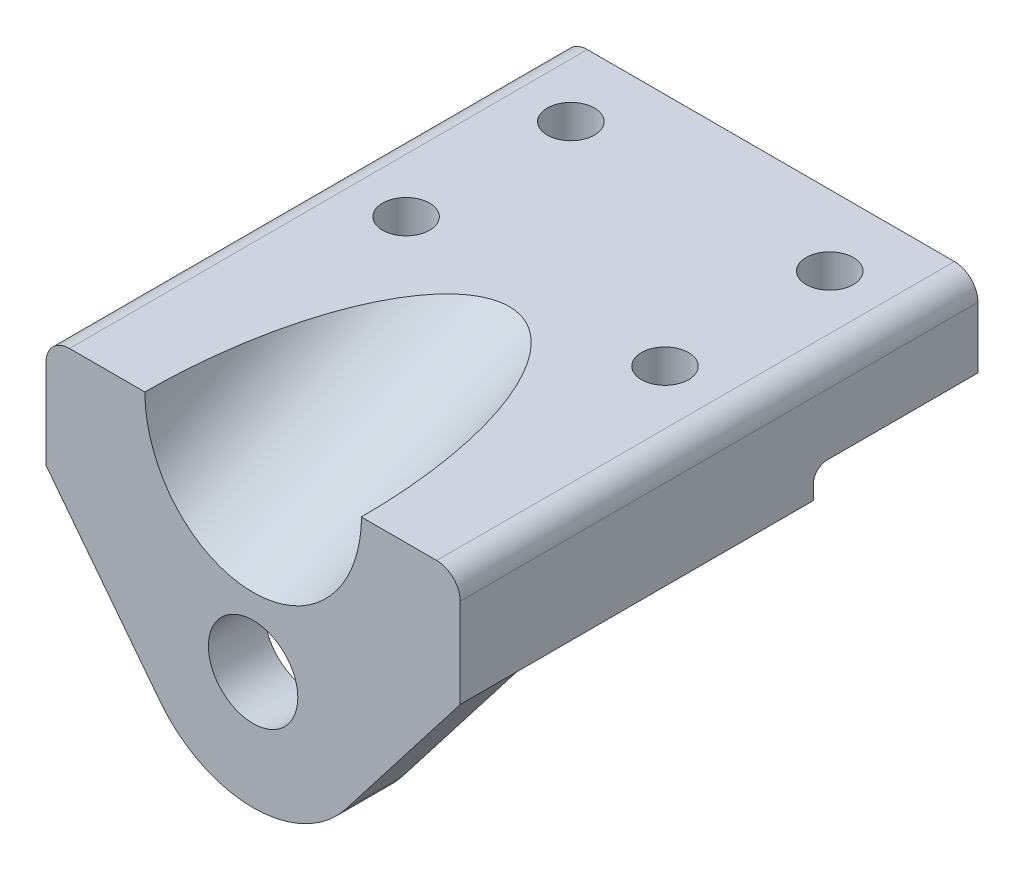
ISO-10303-21;
HEADER;
FILE_DESCRIPTION(('STEP AP214'),'2;1');
FILE_NAME('part.step','',(''),(''),'','','');
FILE_SCHEMA(('AUTOMOTIVE_DESIGN { 1 0 10303 214 1 1 1 1 }'));
ENDSEC;
DATA;
#1=APPLICATION_CONTEXT('core data for automotive mechanical design processes');
#2=APPLICATION_PROTOCOL_DEFINITION('international standard','automotive_design',2000,#1);
#3=PRODUCT_CONTEXT('',#1,'mechanical');
#4=PRODUCT('Part','Part','',(#3));
#5=PRODUCT_RELATED_PRODUCT_CATEGORY('part','',(#4));
#6=PRODUCT_DEFINITION_FORMATION('','',#4);
#7=PRODUCT_DEFINITION_CONTEXT('part definition',#1,'design');
#8=PRODUCT_DEFINITION('design','',#6,#7);
#9=PRODUCT_DEFINITION_SHAPE('','',#8);
#10=(LENGTH_UNIT() NAMED_UNIT(*) SI_UNIT(.MILLI.,.METRE.));
#11=(NAMED_UNIT(*) PLANE_ANGLE_UNIT() SI_UNIT($,.RADIAN.));
#12=(NAMED_UNIT(*) SI_UNIT($,.STERADIAN.) SOLID_ANGLE_UNIT());
#13=UNCERTAINTY_MEASURE_WITH_UNIT(LENGTH_MEASURE(1.E-05),#10,'distance_accuracy_value','');
#14=(GEOMETRIC_REPRESENTATION_CONTEXT(3) GLOBAL_UNCERTAINTY_ASSIGNED_CONTEXT((#13)) GLOBAL_UNIT_ASSIGNED_CONTEXT((#10,
#11,#12)) REPRESENTATION_CONTEXT('',''));
#15=CARTESIAN_POINT('',(0.,0.,0.));
#16=DIRECTION('',(0.,0.,1.));
#17=DIRECTION('',(1.,0.,0.));
#18=AXIS2_PLACEMENT_3D('',#15,#16,#17);
#19=CARTESIAN_POINT('',(44.,-24.,0.));
#20=DIRECTION('',(1.,0.,0.));
#21=DIRECTION('',(0.,0.,-1.));
#22=AXIS2_PLACEMENT_3D('',#19,#20,#21);
#23=PLANE('',#22);
#24=DIRECTION('',(0.,-1.,0.));
#25=VECTOR('',#24,1.);
#26=CARTESIAN_POINT('',(44.,-24.,-75.));
#27=LINE('',#26,#25);
#28=CARTESIAN_POINT('',(44.,-21.,-75.));
#29=VERTEX_POINT('',#28);
#30=CARTESIAN_POINT('',(44.,-24.,-75.));
#31=VERTEX_POINT('',#30);
#32=EDGE_CURVE('E243',#29,#31,#27,.T.);
#33=ORIENTED_EDGE('',*,*,#32,.F.);
#34=CARTESIAN_POINT('',(44.,-21.,-78.));
#35=DIRECTION('',(1.,0.,0.));
#36=DIRECTION('',(0.,0.,-1.));
#37=AXIS2_PLACEMENT_3D('',#34,#35,#36);
#38=CIRCLE('',#37,3.);
#39=CARTESIAN_POINT('',(44.,-18.,-78.));
#40=VERTEX_POINT('',#39);
#41=EDGE_CURVE('E220',#29,#40,#38,.F.);
#42=ORIENTED_EDGE('',*,*,#41,.T.);
#43=DIRECTION('',(0.,0.,-1.));
#44=VECTOR('',#43,1.);
#45=CARTESIAN_POINT('',(44.,-18.,-75.));
#46=LINE('',#45,#44);
#47=CARTESIAN_POINT('',(44.,-18.,-110.));
#48=VERTEX_POINT('',#47);
#49=EDGE_CURVE('E214',#40,#48,#46,.T.);
#50=ORIENTED_EDGE('',*,*,#49,.T.);
#51=DIRECTION('',(0.,1.,0.));
#52=VECTOR('',#51,1.);
#53=CARTESIAN_POINT('',(44.,-24.,-110.));
#54=LINE('',#53,#52);
#55=CARTESIAN_POINT('',(44.,-5.,-110.));
#56=VERTEX_POINT('',#55);
#57=EDGE_CURVE('E179',#48,#56,#54,.T.);
#58=ORIENTED_EDGE('',*,*,#57,.T.);
#59=DIRECTION('',(0.,0.,-1.));
#60=VECTOR('',#59,1.);
#61=CARTESIAN_POINT('',(44.,-5.,0.));
#62=LINE('',#61,#60);
#63=CARTESIAN_POINT('',(44.,-5.,0.));
#64=VERTEX_POINT('',#63);
#65=EDGE_CURVE('E205',#56,#64,#62,.F.);
#66=ORIENTED_EDGE('',*,*,#65,.T.);
#67=DIRECTION('',(0.,1.,0.));
#68=VECTOR('',#67,1.);
#69=CARTESIAN_POINT('',(44.,-24.,0.));
#70=LINE('',#69,#68);
#71=CARTESIAN_POINT('',(44.,-24.,0.));
#72=VERTEX_POINT('',#71);
#73=EDGE_CURVE('E167',#72,#64,#70,.T.);
#74=ORIENTED_EDGE('',*,*,#73,.F.);
#75=DIRECTION('',(0.,0.,-1.));
#76=VECTOR('',#75,1.);
#77=CARTESIAN_POINT('',(44.,-24.,0.));
#78=LINE('',#77,#76);
#79=CARTESIAN_POINT('',(44.,-24.,-12.));
#80=VERTEX_POINT('',#79);
#81=EDGE_CURVE('E161',#72,#80,#78,.T.);
#82=ORIENTED_EDGE('',*,*,#81,.T.);
#83=EDGE_CURVE('E156',#80,#31,#78,.T.);
#84=ORIENTED_EDGE('',*,*,#83,.T.);
#85=EDGE_LOOP('',(#33,#42,#50,#58,#66,#74,#82,#84));
#86=FACE_BOUND('',#85,.T.);
#87=ADVANCED_FACE('F43',(#86),#23,.T.);
#88=CARTESIAN_POINT('',(-44.,-24.,0.));
#89=DIRECTION('',(0.,0.,1.));
#90=DIRECTION('',(1.,0.,0.));
#91=AXIS2_PLACEMENT_3D('',#88,#89,#90);
#92=PLANE('',#91);
#93=DIRECTION('',(1.,0.,0.));
#94=VECTOR('',#93,1.);
#95=CARTESIAN_POINT('',(-44.,0.,0.));
#96=LINE('',#95,#94);
#97=CARTESIAN_POINT('',(23.,0.,0.));
#98=VERTEX_POINT('',#97);
#99=CARTESIAN_POINT('',(39.,0.,0.));
#100=VERTEX_POINT('',#99);
#101=EDGE_CURVE('E146',#98,#100,#96,.T.);
#102=ORIENTED_EDGE('',*,*,#101,.F.);
#103=CARTESIAN_POINT('',(0.,0.,0.));
#104=DIRECTION('',(0.,0.,1.));
#105=DIRECTION('',(0.,-1.,0.));
#106=AXIS2_PLACEMENT_3D('',#103,#104,#105);
#107=ELLIPSE('',#106,25.3776921361373,23.);
#108=CARTESIAN_POINT('',(-23.,0.,0.));
#109=VERTEX_POINT('',#108);
#110=EDGE_CURVE('E58',#98,#109,#107,.F.);
#111=ORIENTED_EDGE('',*,*,#110,.T.);
#112=CARTESIAN_POINT('',(-39.,0.,0.));
#113=VERTEX_POINT('',#112);
#114=EDGE_CURVE('E144',#113,#109,#96,.T.);
#115=ORIENTED_EDGE('',*,*,#114,.F.);
#116=CARTESIAN_POINT('',(-39.,-5.,0.));
#117=DIRECTION('',(0.,0.,1.));
#118=DIRECTION('',(1.,0.,0.));
#119=AXIS2_PLACEMENT_3D('',#116,#117,#118);
#120=CIRCLE('',#119,5.);
#121=CARTESIAN_POINT('',(-44.,-5.,0.));
#122=VERTEX_POINT('',#121);
#123=EDGE_CURVE('E191',#113,#122,#120,.T.);
#124=ORIENTED_EDGE('',*,*,#123,.T.);
#125=DIRECTION('',(0.,1.,0.));
#126=VECTOR('',#125,1.);
#127=CARTESIAN_POINT('',(-44.,-24.,0.));
#128=LINE('',#127,#126);
#129=CARTESIAN_POINT('',(-44.,-24.,0.));
#130=VERTEX_POINT('',#129);
#131=EDGE_CURVE('E172',#130,#122,#128,.T.);
#132=ORIENTED_EDGE('',*,*,#131,.F.);
#133=DIRECTION('',(0.612114706356877,-0.790768984129773,0.));
#134=VECTOR('',#133,1.);
#135=CARTESIAN_POINT('',(-44.,-24.,0.));
#136=LINE('',#135,#134);
#137=CARTESIAN_POINT('',(-19.7692246032443,-55.3028676589219,0.));
#138=VERTEX_POINT('',#137);
#139=EDGE_CURVE('E262',#130,#138,#136,.T.);
#140=ORIENTED_EDGE('',*,*,#139,.T.);
#141=CARTESIAN_POINT('',(0.,-40.,0.));
#142=DIRECTION('',(0.,0.,1.));
#143=DIRECTION('',(1.,0.,0.));
#144=AXIS2_PLACEMENT_3D('',#141,#142,#143);
#145=CIRCLE('',#144,25.);
#146=CARTESIAN_POINT('',(19.7692246032443,-55.3028676589219,0.));
#147=VERTEX_POINT('',#146);
#148=EDGE_CURVE('E287',#138,#147,#145,.T.);
#149=ORIENTED_EDGE('',*,*,#148,.T.);
#150=DIRECTION('',(0.612114706356877,0.790768984129774,0.));
#151=VECTOR('',#150,1.);
#152=CARTESIAN_POINT('',(44.,-24.,0.));
#153=LINE('',#152,#151);
#154=EDGE_CURVE('E271',#147,#72,#153,.T.);
#155=ORIENTED_EDGE('',*,*,#154,.T.);
#156=ORIENTED_EDGE('',*,*,#73,.T.);
#157=CARTESIAN_POINT('',(39.,-5.,0.));
#158=DIRECTION('',(0.,0.,1.));
#159=DIRECTION('',(1.,0.,0.));
#160=AXIS2_PLACEMENT_3D('',#157,#158,#159);
#161=CIRCLE('',#160,5.);
#162=EDGE_CURVE('E188',#64,#100,#161,.T.);
#163=ORIENTED_EDGE('',*,*,#162,.T.);
#164=EDGE_LOOP('',(#102,#111,#115,#124,#132,#140,#149,#155,#156,#163));
#165=FACE_BOUND('',#164,.T.);
#166=CARTESIAN_POINT('',(0.,-40.,0.));
#167=DIRECTION('',(0.,0.,1.));
#168=DIRECTION('',(1.,0.,0.));
#169=AXIS2_PLACEMENT_3D('',#166,#167,#168);
#170=CIRCLE('',#169,9.5);
#171=CARTESIAN_POINT('',(9.5,-40.,0.));
#172=VERTEX_POINT('',#171);
#173=EDGE_CURVE('E257',#172,#172,#170,.T.);
#174=ORIENTED_EDGE('',*,*,#173,.F.);
#175=EDGE_LOOP('',(#174));
#176=FACE_BOUND('',#175,.T.);
#177=ADVANCED_FACE('F142',(#165,#176),#92,.T.);
#178=CARTESIAN_POINT('',(-44.,-24.,-110.));
#179=DIRECTION('',(-1.,0.,0.));
#180=DIRECTION('',(0.,0.,1.));
#181=AXIS2_PLACEMENT_3D('',#178,#179,#180);
#182=PLANE('',#181);
#183=DIRECTION('',(0.,0.,-1.));
#184=VECTOR('',#183,1.);
#185=CARTESIAN_POINT('',(-44.,-18.,-75.));
#186=LINE('',#185,#184);
#187=CARTESIAN_POINT('',(-44.,-18.,-78.));
#188=VERTEX_POINT('',#187);
#189=CARTESIAN_POINT('',(-44.,-18.,-110.));
#190=VERTEX_POINT('',#189);
#191=EDGE_CURVE('E231',#188,#190,#186,.T.);
#192=ORIENTED_EDGE('',*,*,#191,.F.);
#193=CARTESIAN_POINT('',(-44.,-21.,-78.));
#194=DIRECTION('',(-1.,0.,0.));
#195=DIRECTION('',(0.,0.,1.));
#196=AXIS2_PLACEMENT_3D('',#193,#194,#195);
#197=CIRCLE('',#196,3.);
#198=CARTESIAN_POINT('',(-44.,-21.,-75.));
#199=VERTEX_POINT('',#198);
#200=EDGE_CURVE('E52',#188,#199,#197,.F.);
#201=ORIENTED_EDGE('',*,*,#200,.T.);
#202=DIRECTION('',(0.,1.,0.));
#203=VECTOR('',#202,1.);
#204=CARTESIAN_POINT('',(-44.,-24.,-75.));
#205=LINE('',#204,#203);
#206=CARTESIAN_POINT('',(-44.,-24.,-75.));
#207=VERTEX_POINT('',#206);
#208=EDGE_CURVE('E228',#207,#199,#205,.T.);
#209=ORIENTED_EDGE('',*,*,#208,.F.);
#210=DIRECTION('',(0.,0.,1.));
#211=VECTOR('',#210,1.);
#212=CARTESIAN_POINT('',(-44.,-24.,-110.));
#213=LINE('',#212,#211);
#214=CARTESIAN_POINT('',(-44.,-24.,-12.));
#215=VERTEX_POINT('',#214);
#216=EDGE_CURVE('E182',#207,#215,#213,.T.);
#217=ORIENTED_EDGE('',*,*,#216,.T.);
#218=DIRECTION('',(0.,0.,1.));
#219=VECTOR('',#218,1.);
#220=CARTESIAN_POINT('',(-44.,-24.,-12.));
#221=LINE('',#220,#219);
#222=EDGE_CURVE('E283',#215,#130,#221,.T.);
#223=ORIENTED_EDGE('',*,*,#222,.T.);
#224=ORIENTED_EDGE('',*,*,#131,.T.);
#225=DIRECTION('',(0.,0.,1.));
#226=VECTOR('',#225,1.);
#227=CARTESIAN_POINT('',(-44.,-5.,-110.));
#228=LINE('',#227,#226);
#229=CARTESIAN_POINT('',(-44.,-5.,-110.));
#230=VERTEX_POINT('',#229);
#231=EDGE_CURVE('E194',#122,#230,#228,.F.);
#232=ORIENTED_EDGE('',*,*,#231,.T.);
#233=DIRECTION('',(0.,1.,0.));
#234=VECTOR('',#233,1.);
#235=CARTESIAN_POINT('',(-44.,-24.,-110.));
#236=LINE('',#235,#234);
#237=EDGE_CURVE('E176',#190,#230,#236,.T.);
#238=ORIENTED_EDGE('',*,*,#237,.F.);
#239=EDGE_LOOP('',(#192,#201,#209,#217,#223,#224,#232,#238));
#240=FACE_BOUND('',#239,.T.);
#241=ADVANCED_FACE('F227',(#240),#182,.T.);
#242=CARTESIAN_POINT('',(44.,-24.,-110.));
#243=DIRECTION('',(0.,0.,-1.));
#244=DIRECTION('',(-1.,0.,0.));
#245=AXIS2_PLACEMENT_3D('',#242,#243,#244);
#246=PLANE('',#245);
#247=DIRECTION('',(1.,0.,0.));
#248=VECTOR('',#247,1.);
#249=CARTESIAN_POINT('',(44.,-18.,-110.));
#250=LINE('',#249,#248);
#251=EDGE_CURVE('E148',#190,#48,#250,.T.);
#252=ORIENTED_EDGE('',*,*,#251,.F.);
#253=ORIENTED_EDGE('',*,*,#237,.T.);
#254=CARTESIAN_POINT('',(-39.,-5.,-110.));
#255=DIRECTION('',(0.,0.,-1.));
#256=DIRECTION('',(-1.,0.,0.));
#257=AXIS2_PLACEMENT_3D('',#254,#255,#256);
#258=CIRCLE('',#257,5.);
#259=CARTESIAN_POINT('',(-39.,0.,-110.));
#260=VERTEX_POINT('',#259);
#261=EDGE_CURVE('E202',#230,#260,#258,.T.);
#262=ORIENTED_EDGE('',*,*,#261,.T.);
#263=DIRECTION('',(-1.,0.,0.));
#264=VECTOR('',#263,1.);
#265=CARTESIAN_POINT('',(44.,0.,-110.));
#266=LINE('',#265,#264);
#267=CARTESIAN_POINT('',(39.,0.,-110.));
#268=VERTEX_POINT('',#267);
#269=EDGE_CURVE('E163',#268,#260,#266,.T.);
#270=ORIENTED_EDGE('',*,*,#269,.F.);
#271=CARTESIAN_POINT('',(39.,-5.,-110.));
#272=DIRECTION('',(0.,0.,-1.));
#273=DIRECTION('',(-1.,0.,0.));
#274=AXIS2_PLACEMENT_3D('',#271,#272,#273);
#275=CIRCLE('',#274,5.);
#276=EDGE_CURVE('E198',#268,#56,#275,.T.);
#277=ORIENTED_EDGE('',*,*,#276,.T.);
#278=ORIENTED_EDGE('',*,*,#57,.F.);
#279=EDGE_LOOP('',(#252,#253,#262,#270,#277,#278));
#280=FACE_BOUND('',#279,.T.);
#281=ADVANCED_FACE('F366',(#280),#246,.T.);
#282=CARTESIAN_POINT('',(0.,-24.,0.));
#283=DIRECTION('',(0.,1.,0.));
#284=DIRECTION('',(0.,0.,1.));
#285=AXIS2_PLACEMENT_3D('',#282,#283,#284);
#286=PLANE('',#285);
#287=CARTESIAN_POINT('',(27.5,-24.,-60.));
#288=DIRECTION('',(0.,1.,0.));
#289=DIRECTION('',(0.,0.,1.));
#290=AXIS2_PLACEMENT_3D('',#287,#288,#289);
#291=CIRCLE('',#290,4.99999999999999);
#292=CARTESIAN_POINT('',(27.5,-24.,-55.));
#293=VERTEX_POINT('',#292);
#294=EDGE_CURVE('E308',#293,#293,#291,.T.);
#295=ORIENTED_EDGE('',*,*,#294,.T.);
#296=EDGE_LOOP('',(#295));
#297=FACE_BOUND('',#296,.T.);
#298=CARTESIAN_POINT('',(-27.5,-24.,-60.));
#299=DIRECTION('',(0.,1.,0.));
#300=DIRECTION('',(0.,0.,1.));
#301=AXIS2_PLACEMENT_3D('',#298,#299,#300);
#302=CIRCLE('',#301,5.);
#303=CARTESIAN_POINT('',(-27.5,-24.,-55.));
#304=VERTEX_POINT('',#303);
#305=EDGE_CURVE('E316',#304,#304,#302,.T.);
#306=ORIENTED_EDGE('',*,*,#305,.T.);
#307=EDGE_LOOP('',(#306));
#308=FACE_BOUND('',#307,.T.);
#309=ORIENTED_EDGE('',*,*,#216,.F.);
#310=DIRECTION('',(-1.,0.,0.));
#311=VECTOR('',#310,1.);
#312=CARTESIAN_POINT('',(44.,-24.,-75.));
#313=LINE('',#312,#311);
#314=EDGE_CURVE('E238',#31,#207,#313,.T.);
#315=ORIENTED_EDGE('',*,*,#314,.F.);
#316=ORIENTED_EDGE('',*,*,#83,.F.);
#317=DIRECTION('',(-1.,0.,0.));
#318=VECTOR('',#317,1.);
#319=CARTESIAN_POINT('',(-44.,-24.,-12.));
#320=LINE('',#319,#318);
#321=EDGE_CURVE('E266',#80,#215,#320,.T.);
#322=ORIENTED_EDGE('',*,*,#321,.T.);
#323=EDGE_LOOP('',(#309,#315,#316,#322));
#324=FACE_BOUND('',#323,.T.);
#325=ADVANCED_FACE('F340',(#297,#308,#324),#286,.F.);
#326=CARTESIAN_POINT('',(0.,0.,0.));
#327=DIRECTION('',(0.,1.,0.));
#328=DIRECTION('',(0.,0.,1.));
#329=AXIS2_PLACEMENT_3D('',#326,#327,#328);
#330=PLANE('',#329);
#331=CARTESIAN_POINT('',(27.5,0.,-95.));
#332=DIRECTION('',(0.,1.,0.));
#333=DIRECTION('',(0.,0.,1.));
#334=AXIS2_PLACEMENT_3D('',#331,#332,#333);
#335=CIRCLE('',#334,5.);
#336=CARTESIAN_POINT('',(27.5,0.,-90.));
#337=VERTEX_POINT('',#336);
#338=EDGE_CURVE('E297',#337,#337,#335,.T.);
#339=ORIENTED_EDGE('',*,*,#338,.F.);
#340=EDGE_LOOP('',(#339));
#341=FACE_BOUND('',#340,.T.);
#342=CARTESIAN_POINT('',(27.5,0.,-60.));
#343=DIRECTION('',(0.,1.,0.));
#344=DIRECTION('',(0.,0.,1.));
#345=AXIS2_PLACEMENT_3D('',#342,#343,#344);
#346=CIRCLE('',#345,4.99999999999999);
#347=CARTESIAN_POINT('',(27.5,0.,-55.));
#348=VERTEX_POINT('',#347);
#349=EDGE_CURVE('E307',#348,#348,#346,.T.);
#350=ORIENTED_EDGE('',*,*,#349,.F.);
#351=EDGE_LOOP('',(#350));
#352=FACE_BOUND('',#351,.T.);
#353=CARTESIAN_POINT('',(-27.5,0.,-60.));
#354=DIRECTION('',(0.,1.,0.));
#355=DIRECTION('',(0.,0.,1.));
#356=AXIS2_PLACEMENT_3D('',#353,#354,#355);
#357=CIRCLE('',#356,5.);
#358=CARTESIAN_POINT('',(-27.5,0.,-55.));
#359=VERTEX_POINT('',#358);
#360=EDGE_CURVE('E312',#359,#359,#357,.T.);
#361=ORIENTED_EDGE('',*,*,#360,.F.);
#362=EDGE_LOOP('',(#361));
#363=FACE_BOUND('',#362,.T.);
#364=CARTESIAN_POINT('',(-27.5,0.,-95.));
#365=DIRECTION('',(0.,1.,0.));
#366=DIRECTION('',(0.,0.,1.));
#367=AXIS2_PLACEMENT_3D('',#364,#365,#366);
#368=CIRCLE('',#367,5.);
#369=CARTESIAN_POINT('',(-27.5,0.,-90.));
#370=VERTEX_POINT('',#369);
#371=EDGE_CURVE('E320',#370,#370,#368,.T.);
#372=ORIENTED_EDGE('',*,*,#371,.F.);
#373=EDGE_LOOP('',(#372));
#374=FACE_BOUND('',#373,.T.);
#375=ORIENTED_EDGE('',*,*,#114,.T.);
#376=CARTESIAN_POINT('',(0.,0.,0.));
#377=DIRECTION('',(0.,1.,0.));
#378=DIRECTION('',(0.,0.,1.));
#379=AXIS2_PLACEMENT_3D('',#376,#377,#378);
#380=ELLIPSE('',#379,54.4226364125078,23.);
#381=EDGE_CURVE('E11',#109,#98,#380,.F.);
#382=ORIENTED_EDGE('',*,*,#381,.T.);
#383=ORIENTED_EDGE('',*,*,#101,.T.);
#384=DIRECTION('',(0.,0.,-1.));
#385=VECTOR('',#384,1.);
#386=CARTESIAN_POINT('',(39.,0.,0.));
#387=LINE('',#386,#385);
#388=EDGE_CURVE('E171',#100,#268,#387,.T.);
#389=ORIENTED_EDGE('',*,*,#388,.T.);
#390=ORIENTED_EDGE('',*,*,#269,.T.);
#391=DIRECTION('',(0.,0.,1.));
#392=VECTOR('',#391,1.);
#393=CARTESIAN_POINT('',(-39.,0.,0.));
#394=LINE('',#393,#392);
#395=EDGE_CURVE('E154',#260,#113,#394,.T.);
#396=ORIENTED_EDGE('',*,*,#395,.T.);
#397=EDGE_LOOP('',(#375,#382,#383,#389,#390,#396));
#398=FACE_BOUND('',#397,.T.);
#399=ADVANCED_FACE('F151',(#341,#352,#363,#374,#398),#330,.T.);
#400=CARTESIAN_POINT('',(-27.5,-24.,-95.));
#401=DIRECTION('',(0.,1.,0.));
#402=DIRECTION('',(0.,0.,1.));
#403=AXIS2_PLACEMENT_3D('',#400,#401,#402);
#404=CYLINDRICAL_SURFACE('',#403,5.);
#405=CARTESIAN_POINT('',(-27.5,-18.,-95.));
#406=DIRECTION('',(0.,1.,0.));
#407=DIRECTION('',(0.,0.,1.));
#408=AXIS2_PLACEMENT_3D('',#405,#406,#407);
#409=CIRCLE('',#408,5.);
#410=CARTESIAN_POINT('',(-27.5,-18.,-90.));
#411=VERTEX_POINT('',#410);
#412=EDGE_CURVE('E213',#411,#411,#409,.F.);
#413=ORIENTED_EDGE('',*,*,#412,.T.);
#414=EDGE_LOOP('',(#413));
#415=FACE_BOUND('',#414,.T.);
#416=ORIENTED_EDGE('',*,*,#371,.T.);
#417=EDGE_LOOP('',(#416));
#418=FACE_BOUND('',#417,.T.);
#419=ADVANCED_FACE('F403',(#415,#418),#404,.F.);
#420=CARTESIAN_POINT('',(-27.5,-24.,-60.));
#421=DIRECTION('',(0.,1.,0.));
#422=DIRECTION('',(0.,0.,1.));
#423=AXIS2_PLACEMENT_3D('',#420,#421,#422);
#424=CYLINDRICAL_SURFACE('',#423,5.);
#425=ORIENTED_EDGE('',*,*,#305,.F.);
#426=EDGE_LOOP('',(#425));
#427=FACE_BOUND('',#426,.T.);
#428=ORIENTED_EDGE('',*,*,#360,.T.);
#429=EDGE_LOOP('',(#428));
#430=FACE_BOUND('',#429,.T.);
#431=ADVANCED_FACE('F408',(#427,#430),#424,.F.);
#432=CARTESIAN_POINT('',(27.5,-24.,-60.));
#433=DIRECTION('',(0.,1.,0.));
#434=DIRECTION('',(0.,0.,1.));
#435=AXIS2_PLACEMENT_3D('',#432,#433,#434);
#436=CYLINDRICAL_SURFACE('',#435,4.99999999999999);
#437=ORIENTED_EDGE('',*,*,#294,.F.);
#438=EDGE_LOOP('',(#437));
#439=FACE_BOUND('',#438,.T.);
#440=ORIENTED_EDGE('',*,*,#349,.T.);
#441=EDGE_LOOP('',(#440));
#442=FACE_BOUND('',#441,.T.);
#443=ADVANCED_FACE('F412',(#439,#442),#436,.F.);
#444=CARTESIAN_POINT('',(27.5,-24.,-95.));
#445=DIRECTION('',(0.,1.,0.));
#446=DIRECTION('',(0.,0.,1.));
#447=AXIS2_PLACEMENT_3D('',#444,#445,#446);
#448=CYLINDRICAL_SURFACE('',#447,5.);
#449=CARTESIAN_POINT('',(27.5,-18.,-95.));
#450=DIRECTION('',(0.,1.,0.));
#451=DIRECTION('',(0.,0.,1.));
#452=AXIS2_PLACEMENT_3D('',#449,#450,#451);
#453=CIRCLE('',#452,5.);
#454=CARTESIAN_POINT('',(27.5,-18.,-90.));
#455=VERTEX_POINT('',#454);
#456=EDGE_CURVE('E209',#455,#455,#453,.F.);
#457=ORIENTED_EDGE('',*,*,#456,.T.);
#458=EDGE_LOOP('',(#457));
#459=FACE_BOUND('',#458,.T.);
#460=ORIENTED_EDGE('',*,*,#338,.T.);
#461=EDGE_LOOP('',(#460));
#462=FACE_BOUND('',#461,.T.);
#463=ADVANCED_FACE('F356',(#459,#462),#448,.F.);
#464=CARTESIAN_POINT('',(44.,-24.,-12.));
#465=DIRECTION('',(0.790768984129773,-0.612114706356877,0.));
#466=DIRECTION('',(0.612114706356877,0.790768984129774,0.));
#467=AXIS2_PLACEMENT_3D('',#464,#465,#466);
#468=PLANE('',#467);
#469=ORIENTED_EDGE('',*,*,#154,.F.);
#470=DIRECTION('',(0.,0.,1.));
#471=VECTOR('',#470,1.);
#472=CARTESIAN_POINT('',(19.7692246032443,-55.3028676589219,-12.));
#473=LINE('',#472,#471);
#474=CARTESIAN_POINT('',(19.7692246032443,-55.3028676589219,-12.));
#475=VERTEX_POINT('',#474);
#476=EDGE_CURVE('E294',#475,#147,#473,.T.);
#477=ORIENTED_EDGE('',*,*,#476,.F.);
#478=DIRECTION('',(0.612114706356877,0.790768984129774,0.));
#479=VECTOR('',#478,1.);
#480=CARTESIAN_POINT('',(44.,-24.,-12.));
#481=LINE('',#480,#479);
#482=EDGE_CURVE('E279',#475,#80,#481,.T.);
#483=ORIENTED_EDGE('',*,*,#482,.T.);
#484=ORIENTED_EDGE('',*,*,#81,.F.);
#485=EDGE_LOOP('',(#469,#477,#483,#484));
#486=FACE_BOUND('',#485,.T.);
#487=ADVANCED_FACE('F344',(#486),#468,.T.);
#488=CARTESIAN_POINT('',(0.,-40.,-12.));
#489=DIRECTION('',(0.,0.,1.));
#490=DIRECTION('',(1.,0.,0.));
#491=AXIS2_PLACEMENT_3D('',#488,#489,#490);
#492=CYLINDRICAL_SURFACE('',#491,25.);
#493=ORIENTED_EDGE('',*,*,#148,.F.);
#494=DIRECTION('',(0.,0.,1.));
#495=VECTOR('',#494,1.);
#496=CARTESIAN_POINT('',(-19.7692246032443,-55.3028676589219,-12.));
#497=LINE('',#496,#495);
#498=CARTESIAN_POINT('',(-19.7692246032443,-55.3028676589219,-12.));
#499=VERTEX_POINT('',#498);
#500=EDGE_CURVE('E298',#499,#138,#497,.T.);
#501=ORIENTED_EDGE('',*,*,#500,.F.);
#502=CARTESIAN_POINT('',(0.,-40.,-12.));
#503=DIRECTION('',(0.,0.,1.));
#504=DIRECTION('',(1.,0.,0.));
#505=AXIS2_PLACEMENT_3D('',#502,#503,#504);
#506=CIRCLE('',#505,25.);
#507=EDGE_CURVE('E275',#499,#475,#506,.T.);
#508=ORIENTED_EDGE('',*,*,#507,.T.);
#509=ORIENTED_EDGE('',*,*,#476,.T.);
#510=EDGE_LOOP('',(#493,#501,#508,#509));
#511=FACE_BOUND('',#510,.T.);
#512=ADVANCED_FACE('F348',(#511),#492,.T.);
#513=CARTESIAN_POINT('',(-44.,-24.,-12.));
#514=DIRECTION('',(-0.790768984129773,-0.612114706356877,0.));
#515=DIRECTION('',(0.612114706356877,-0.790768984129773,0.));
#516=AXIS2_PLACEMENT_3D('',#513,#514,#515);
#517=PLANE('',#516);
#518=ORIENTED_EDGE('',*,*,#139,.F.);
#519=ORIENTED_EDGE('',*,*,#222,.F.);
#520=DIRECTION('',(0.612114706356877,-0.790768984129773,0.));
#521=VECTOR('',#520,1.);
#522=CARTESIAN_POINT('',(-44.,-24.,-12.));
#523=LINE('',#522,#521);
#524=EDGE_CURVE('E270',#215,#499,#523,.T.);
#525=ORIENTED_EDGE('',*,*,#524,.T.);
#526=ORIENTED_EDGE('',*,*,#500,.T.);
#527=EDGE_LOOP('',(#518,#519,#525,#526));
#528=FACE_BOUND('',#527,.T.);
#529=ADVANCED_FACE('F338',(#528),#517,.T.);
#530=CARTESIAN_POINT('',(0.,-40.,-12.));
#531=DIRECTION('',(0.,0.,1.));
#532=DIRECTION('',(1.,0.,0.));
#533=AXIS2_PLACEMENT_3D('',#530,#531,#532);
#534=PLANE('',#533);
#535=CARTESIAN_POINT('',(0.,-40.,-12.));
#536=DIRECTION('',(0.,0.,1.));
#537=DIRECTION('',(1.,0.,0.));
#538=AXIS2_PLACEMENT_3D('',#535,#536,#537);
#539=CIRCLE('',#538,9.5);
#540=CARTESIAN_POINT('',(9.5,-40.,-12.));
#541=VERTEX_POINT('',#540);
#542=EDGE_CURVE('E258',#541,#541,#539,.T.);
#543=ORIENTED_EDGE('',*,*,#542,.T.);
#544=EDGE_LOOP('',(#543));
#545=FACE_BOUND('',#544,.T.);
#546=ORIENTED_EDGE('',*,*,#321,.F.);
#547=ORIENTED_EDGE('',*,*,#482,.F.);
#548=ORIENTED_EDGE('',*,*,#507,.F.);
#549=ORIENTED_EDGE('',*,*,#524,.F.);
#550=EDGE_LOOP('',(#546,#547,#548,#549));
#551=FACE_BOUND('',#550,.T.);
#552=ADVANCED_FACE('F335',(#545,#551),#534,.F.);
#553=CARTESIAN_POINT('',(0.,-40.,-12.));
#554=DIRECTION('',(0.,0.,1.));
#555=DIRECTION('',(1.,0.,0.));
#556=AXIS2_PLACEMENT_3D('',#553,#554,#555);
#557=CYLINDRICAL_SURFACE('',#556,9.5);
#558=ORIENTED_EDGE('',*,*,#542,.F.);
#559=EDGE_LOOP('',(#558));
#560=FACE_BOUND('',#559,.T.);
#561=ORIENTED_EDGE('',*,*,#173,.T.);
#562=EDGE_LOOP('',(#561));
#563=FACE_BOUND('',#562,.T.);
#564=ADVANCED_FACE('F371',(#560,#563),#557,.F.);
#565=CARTESIAN_POINT('',(-39.,-5.,0.));
#566=DIRECTION('',(0.,0.,1.));
#567=DIRECTION('',(1.,0.,0.));
#568=AXIS2_PLACEMENT_3D('',#565,#566,#567);
#569=CYLINDRICAL_SURFACE('',#568,5.);
#570=ORIENTED_EDGE('',*,*,#261,.F.);
#571=ORIENTED_EDGE('',*,*,#231,.F.);
#572=ORIENTED_EDGE('',*,*,#123,.F.);
#573=ORIENTED_EDGE('',*,*,#395,.F.);
#574=EDGE_LOOP('',(#570,#571,#572,#573));
#575=FACE_BOUND('',#574,.T.);
#576=ADVANCED_FACE('F368',(#575),#569,.T.);
#577=CARTESIAN_POINT('',(39.,-5.,0.));
#578=DIRECTION('',(0.,0.,-1.));
#579=DIRECTION('',(-1.,0.,0.));
#580=AXIS2_PLACEMENT_3D('',#577,#578,#579);
#581=CYLINDRICAL_SURFACE('',#580,5.);
#582=ORIENTED_EDGE('',*,*,#162,.F.);
#583=ORIENTED_EDGE('',*,*,#65,.F.);
#584=ORIENTED_EDGE('',*,*,#276,.F.);
#585=ORIENTED_EDGE('',*,*,#388,.F.);
#586=EDGE_LOOP('',(#582,#583,#584,#585));
#587=FACE_BOUND('',#586,.T.);
#588=ADVANCED_FACE('F370',(#587),#581,.T.);
#589=CARTESIAN_POINT('',(44.,-18.,-75.));
#590=DIRECTION('',(0.,1.,0.));
#591=DIRECTION('',(0.,0.,1.));
#592=AXIS2_PLACEMENT_3D('',#589,#590,#591);
#593=PLANE('',#592);
#594=ORIENTED_EDGE('',*,*,#456,.F.);
#595=EDGE_LOOP('',(#594));
#596=FACE_BOUND('',#595,.T.);
#597=ORIENTED_EDGE('',*,*,#49,.F.);
#598=DIRECTION('',(1.,0.,0.));
#599=VECTOR('',#598,1.);
#600=CARTESIAN_POINT('',(-44.,-18.,-78.));
#601=LINE('',#600,#599);
#602=EDGE_CURVE('E65',#40,#188,#601,.F.);
#603=ORIENTED_EDGE('',*,*,#602,.T.);
#604=ORIENTED_EDGE('',*,*,#191,.T.);
#605=ORIENTED_EDGE('',*,*,#251,.T.);
#606=EDGE_LOOP('',(#597,#603,#604,#605));
#607=FACE_BOUND('',#606,.T.);
#608=ORIENTED_EDGE('',*,*,#412,.F.);
#609=EDGE_LOOP('',(#608));
#610=FACE_BOUND('',#609,.T.);
#611=ADVANCED_FACE('F244',(#596,#607,#610),#593,.F.);
#612=CARTESIAN_POINT('',(0.,0.,-75.));
#613=DIRECTION('',(0.,0.,1.));
#614=DIRECTION('',(1.,0.,0.));
#615=AXIS2_PLACEMENT_3D('',#612,#613,#614);
#616=PLANE('',#615);
#617=ORIENTED_EDGE('',*,*,#208,.T.);
#618=DIRECTION('',(1.,0.,0.));
#619=VECTOR('',#618,1.);
#620=CARTESIAN_POINT('',(44.,-21.,-75.));
#621=LINE('',#620,#619);
#622=EDGE_CURVE('E208',#199,#29,#621,.T.);
#623=ORIENTED_EDGE('',*,*,#622,.T.);
#624=ORIENTED_EDGE('',*,*,#32,.T.);
#625=ORIENTED_EDGE('',*,*,#314,.T.);
#626=EDGE_LOOP('',(#617,#623,#624,#625));
#627=FACE_BOUND('',#626,.T.);
#628=ADVANCED_FACE('F235',(#627),#616,.F.);
#629=CARTESIAN_POINT('',(0.,-21.,-78.));
#630=DIRECTION('',(-1.,0.,0.));
#631=DIRECTION('',(0.,0.,1.));
#632=AXIS2_PLACEMENT_3D('',#629,#630,#631);
#633=CYLINDRICAL_SURFACE('',#632,3.);
#634=ORIENTED_EDGE('',*,*,#200,.F.);
#635=ORIENTED_EDGE('',*,*,#602,.F.);
#636=ORIENTED_EDGE('',*,*,#41,.F.);
#637=ORIENTED_EDGE('',*,*,#622,.F.);
#638=EDGE_LOOP('',(#634,#635,#636,#637));
#639=FACE_BOUND('',#638,.T.);
#640=ADVANCED_FACE('F45',(#639),#633,.F.);
#641=CARTESIAN_POINT('',(0.,46.065390529736,-98.787548786995));
#642=DIRECTION('',(0.,-0.422618261740697,0.906307787036651));
#643=DIRECTION('',(0.,-0.906307787036651,-0.422618261740697));
#644=AXIS2_PLACEMENT_3D('',#641,#642,#643);
#645=CYLINDRICAL_SURFACE('',#644,23.);
#646=ORIENTED_EDGE('',*,*,#381,.F.);
#647=ORIENTED_EDGE('',*,*,#110,.F.);
#648=EDGE_LOOP('',(#646,#647));
#649=FACE_BOUND('',#648,.T.);
#650=ADVANCED_FACE('F136',(#649),#645,.F.);
#651=CLOSED_SHELL('',(#87,#177,#241,#281,#325,#399,#419,#431,#443,#463,#487,#512,#529,#552,#564,
#576,#588,#611,#628,#640,#650));
#652=MANIFOLD_SOLID_BREP('B2',#651);
#653=ADVANCED_BREP_SHAPE_REPRESENTATION('',(#18,#652),#14);
#654=SHAPE_DEFINITION_REPRESENTATION(#9,#653);
ENDSEC;
END-ISO-10303-21;
